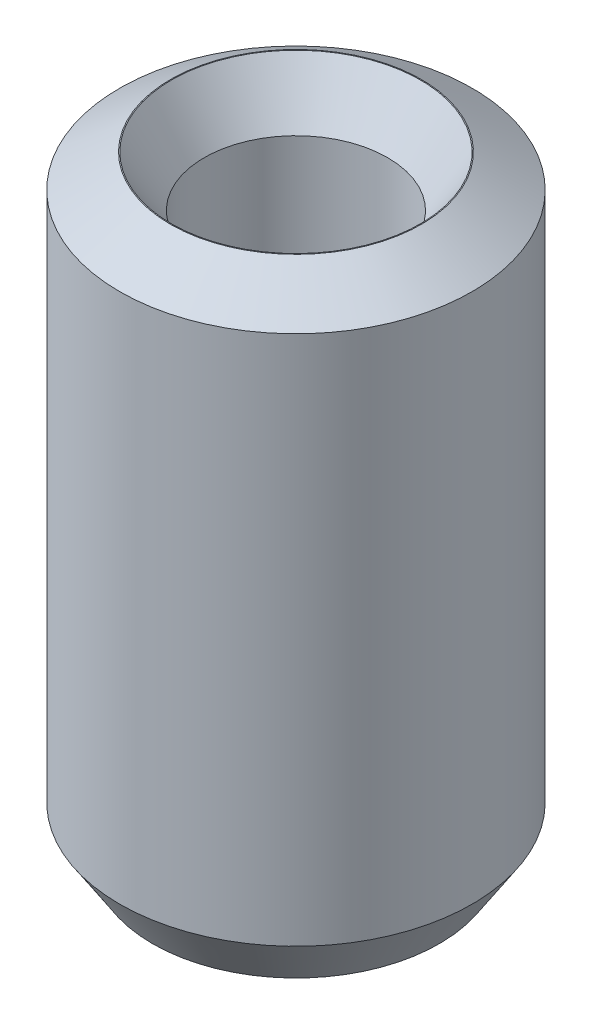
ISO-10303-21;
HEADER;
FILE_DESCRIPTION(('STEP AP214'),'2;1');
FILE_NAME('part.step','',(''),(''),'','','');
FILE_SCHEMA(('AUTOMOTIVE_DESIGN { 1 0 10303 214 1 1 1 1 }'));
ENDSEC;
DATA;
#1=APPLICATION_CONTEXT('core data for automotive mechanical design processes');
#2=APPLICATION_PROTOCOL_DEFINITION('international standard','automotive_design',2000,#1);
#3=PRODUCT_CONTEXT('',#1,'mechanical');
#4=PRODUCT('Part','Part','',(#3));
#5=PRODUCT_RELATED_PRODUCT_CATEGORY('part','',(#4));
#6=PRODUCT_DEFINITION_FORMATION('','',#4);
#7=PRODUCT_DEFINITION_CONTEXT('part definition',#1,'design');
#8=PRODUCT_DEFINITION('design','',#6,#7);
#9=PRODUCT_DEFINITION_SHAPE('','',#8);
#10=(LENGTH_UNIT() NAMED_UNIT(*) SI_UNIT(.MILLI.,.METRE.));
#11=(NAMED_UNIT(*) PLANE_ANGLE_UNIT() SI_UNIT($,.RADIAN.));
#12=(NAMED_UNIT(*) SI_UNIT($,.STERADIAN.) SOLID_ANGLE_UNIT());
#13=UNCERTAINTY_MEASURE_WITH_UNIT(LENGTH_MEASURE(1.E-05),#10,'distance_accuracy_value','');
#14=(GEOMETRIC_REPRESENTATION_CONTEXT(3) GLOBAL_UNCERTAINTY_ASSIGNED_CONTEXT((#13)) GLOBAL_UNIT_ASSIGNED_CONTEXT((#10,
#11,#12)) REPRESENTATION_CONTEXT('',''));
#15=CARTESIAN_POINT('',(0.,0.,0.));
#16=DIRECTION('',(0.,0.,1.));
#17=DIRECTION('',(1.,0.,0.));
#18=AXIS2_PLACEMENT_3D('',#15,#16,#17);
#19=CARTESIAN_POINT('',(0.,43.5572727941653,0.));
#20=DIRECTION('',(0.,-1.,0.));
#21=DIRECTION('',(0.,0.,-1.));
#22=AXIS2_PLACEMENT_3D('',#19,#20,#21);
#23=CYLINDRICAL_SURFACE('',#22,12.5);
#24=CARTESIAN_POINT('',(0.,3.59984109912438,0.));
#25=DIRECTION('',(0.,1.,0.));
#26=DIRECTION('',(0.,0.,1.));
#27=AXIS2_PLACEMENT_3D('',#24,#25,#26);
#28=CIRCLE('',#27,12.5);
#29=CARTESIAN_POINT('',(0.,3.59984109912438,12.5));
#30=VERTEX_POINT('',#29);
#31=EDGE_CURVE('E10',#30,#30,#28,.T.);
#32=ORIENTED_EDGE('',*,*,#31,.T.);
#33=EDGE_LOOP('',(#32));
#34=FACE_BOUND('',#33,.T.);
#35=CARTESIAN_POINT('',(0.,41.2235997079536,0.));
#36=DIRECTION('',(0.,1.,0.));
#37=DIRECTION('',(0.,0.,1.));
#38=AXIS2_PLACEMENT_3D('',#35,#36,#37);
#39=CIRCLE('',#38,12.5);
#40=CARTESIAN_POINT('',(0.,41.2235997079536,12.5));
#41=VERTEX_POINT('',#40);
#42=EDGE_CURVE('E50',#41,#41,#39,.F.);
#43=ORIENTED_EDGE('',*,*,#42,.T.);
#44=EDGE_LOOP('',(#43));
#45=FACE_BOUND('',#44,.T.);
#46=ADVANCED_FACE('F39',(#34,#45),#23,.T.);
#47=CARTESIAN_POINT('',(0.,43.5572727941653,0.));
#48=DIRECTION('',(0.,1.,0.));
#49=DIRECTION('',(0.,0.,1.));
#50=AXIS2_PLACEMENT_3D('',#47,#48,#49);
#51=PLANE('',#50);
#52=CARTESIAN_POINT('',(0.,43.5572727941653,0.));
#53=DIRECTION('',(0.,1.,0.));
#54=DIRECTION('',(0.,0.,1.));
#55=AXIS2_PLACEMENT_3D('',#52,#53,#54);
#56=CIRCLE('',#55,8.83419964848182);
#57=CARTESIAN_POINT('',(0.,43.5572727941653,8.83419964848182));
#58=VERTEX_POINT('',#57);
#59=EDGE_CURVE('E58',#58,#58,#56,.F.);
#60=ORIENTED_EDGE('',*,*,#59,.T.);
#61=EDGE_LOOP('',(#60));
#62=FACE_BOUND('',#61,.T.);
#63=CARTESIAN_POINT('',(0.,43.5572727941653,0.));
#64=DIRECTION('',(0.,1.,0.));
#65=DIRECTION('',(0.,0.,1.));
#66=AXIS2_PLACEMENT_3D('',#63,#64,#65);
#67=CIRCLE('',#66,8.90015890087562);
#68=CARTESIAN_POINT('',(0.,43.5572727941653,8.90015890087562));
#69=VERTEX_POINT('',#68);
#70=EDGE_CURVE('E61',#69,#69,#67,.T.);
#71=ORIENTED_EDGE('',*,*,#70,.T.);
#72=EDGE_LOOP('',(#71));
#73=FACE_BOUND('',#72,.T.);
#74=ADVANCED_FACE('F88',(#62,#73),#51,.T.);
#75=CARTESIAN_POINT('',(0.,0.,0.));
#76=DIRECTION('',(0.,1.,0.));
#77=DIRECTION('',(0.,0.,1.));
#78=AXIS2_PLACEMENT_3D('',#75,#76,#77);
#79=PLANE('',#78);
#80=CARTESIAN_POINT('',(0.,0.,0.));
#81=DIRECTION('',(0.,1.,0.));
#82=DIRECTION('',(0.,0.,1.));
#83=AXIS2_PLACEMENT_3D('',#80,#81,#82);
#84=CIRCLE('',#83,10.1003676613945);
#85=CARTESIAN_POINT('',(0.,0.,10.1003676613945));
#86=VERTEX_POINT('',#85);
#87=EDGE_CURVE('E51',#86,#86,#84,.T.);
#88=ORIENTED_EDGE('',*,*,#87,.T.);
#89=EDGE_LOOP('',(#88));
#90=FACE_BOUND('',#89,.T.);
#91=CARTESIAN_POINT('',(0.,0.,0.));
#92=DIRECTION('',(0.,1.,0.));
#93=DIRECTION('',(0.,0.,1.));
#94=AXIS2_PLACEMENT_3D('',#91,#92,#93);
#95=CIRCLE('',#94,10.1663269137883);
#96=CARTESIAN_POINT('',(0.,0.,10.1663269137883));
#97=VERTEX_POINT('',#96);
#98=EDGE_CURVE('E54',#97,#97,#95,.F.);
#99=ORIENTED_EDGE('',*,*,#98,.T.);
#100=EDGE_LOOP('',(#99));
#101=FACE_BOUND('',#100,.T.);
#102=ADVANCED_FACE('F83',(#90,#101),#79,.F.);
#103=CARTESIAN_POINT('',(0.,43.5572727941653,0.));
#104=DIRECTION('',(0.,-1.,0.));
#105=DIRECTION('',(0.,0.,-1.));
#106=AXIS2_PLACEMENT_3D('',#103,#104,#105);
#107=CYLINDRICAL_SURFACE('',#106,6.50052656227014);
#108=CARTESIAN_POINT('',(0.,39.9574316950409,0.));
#109=DIRECTION('',(0.,1.,0.));
#110=DIRECTION('',(0.,0.,1.));
#111=AXIS2_PLACEMENT_3D('',#108,#109,#110);
#112=CIRCLE('',#111,6.50052656227014);
#113=CARTESIAN_POINT('',(0.,39.9574316950409,6.50052656227014));
#114=VERTEX_POINT('',#113);
#115=EDGE_CURVE('E67',#114,#114,#112,.T.);
#116=ORIENTED_EDGE('',*,*,#115,.T.);
#117=EDGE_LOOP('',(#116));
#118=FACE_BOUND('',#117,.T.);
#119=CARTESIAN_POINT('',(0.,2.33367308621167,0.));
#120=DIRECTION('',(0.,1.,0.));
#121=DIRECTION('',(0.,0.,1.));
#122=AXIS2_PLACEMENT_3D('',#119,#120,#121);
#123=CIRCLE('',#122,6.50052656227014);
#124=CARTESIAN_POINT('',(0.,2.33367308621167,6.50052656227014));
#125=VERTEX_POINT('',#124);
#126=EDGE_CURVE('E69',#125,#125,#123,.F.);
#127=ORIENTED_EDGE('',*,*,#126,.T.);
#128=EDGE_LOOP('',(#127));
#129=FACE_BOUND('',#128,.T.);
#130=ADVANCED_FACE('F71',(#118,#129),#107,.F.);
#131=CARTESIAN_POINT('',(0.,39.9574316950409,0.));
#132=DIRECTION('',(0.,1.,0.));
#133=DIRECTION('',(0.,0.,1.));
#134=AXIS2_PLACEMENT_3D('',#131,#132,#133);
#135=CONICAL_SURFACE('',#134,6.50052656227014,0.57515889163762);
#136=ORIENTED_EDGE('',*,*,#59,.F.);
#137=EDGE_LOOP('',(#136));
#138=FACE_BOUND('',#137,.T.);
#139=ORIENTED_EDGE('',*,*,#115,.F.);
#140=EDGE_LOOP('',(#139));
#141=FACE_BOUND('',#140,.T.);
#142=ADVANCED_FACE('F77',(#138,#141),#135,.F.);
#143=CARTESIAN_POINT('',(0.,0.,0.));
#144=DIRECTION('',(0.,-1.,0.));
#145=DIRECTION('',(0.,0.,-1.));
#146=AXIS2_PLACEMENT_3D('',#143,#144,#145);
#147=CONICAL_SURFACE('',#146,10.1003676613945,0.995637435157275);
#148=ORIENTED_EDGE('',*,*,#126,.F.);
#149=EDGE_LOOP('',(#148));
#150=FACE_BOUND('',#149,.T.);
#151=ORIENTED_EDGE('',*,*,#87,.F.);
#152=EDGE_LOOP('',(#151));
#153=FACE_BOUND('',#152,.T.);
#154=ADVANCED_FACE('F73',(#150,#153),#147,.F.);
#155=CARTESIAN_POINT('',(0.,3.59984109912438,0.));
#156=DIRECTION('',(0.,1.,0.));
#157=DIRECTION('',(0.,0.,1.));
#158=AXIS2_PLACEMENT_3D('',#155,#156,#157);
#159=CONICAL_SURFACE('',#158,12.5,0.575158891637622);
#160=ORIENTED_EDGE('',*,*,#98,.F.);
#161=EDGE_LOOP('',(#160));
#162=FACE_BOUND('',#161,.T.);
#163=ORIENTED_EDGE('',*,*,#31,.F.);
#164=EDGE_LOOP('',(#163));
#165=FACE_BOUND('',#164,.T.);
#166=ADVANCED_FACE('F76',(#162,#165),#159,.T.);
#167=CARTESIAN_POINT('',(0.,43.5572727941653,0.));
#168=DIRECTION('',(0.,-1.,0.));
#169=DIRECTION('',(0.,0.,-1.));
#170=AXIS2_PLACEMENT_3D('',#167,#168,#169);
#171=CONICAL_SURFACE('',#170,8.90015890087562,0.995637435157276);
#172=ORIENTED_EDGE('',*,*,#42,.F.);
#173=EDGE_LOOP('',(#172));
#174=FACE_BOUND('',#173,.T.);
#175=ORIENTED_EDGE('',*,*,#70,.F.);
#176=EDGE_LOOP('',(#175));
#177=FACE_BOUND('',#176,.T.);
#178=ADVANCED_FACE('F45',(#174,#177),#171,.T.);
#179=CLOSED_SHELL('',(#46,#74,#102,#130,#142,#154,#166,#178));
#180=MANIFOLD_SOLID_BREP('B2',#179);
#181=ADVANCED_BREP_SHAPE_REPRESENTATION('',(#18,#180),#14);
#182=SHAPE_DEFINITION_REPRESENTATION(#9,#181);
ENDSEC;
END-ISO-10303-21;
